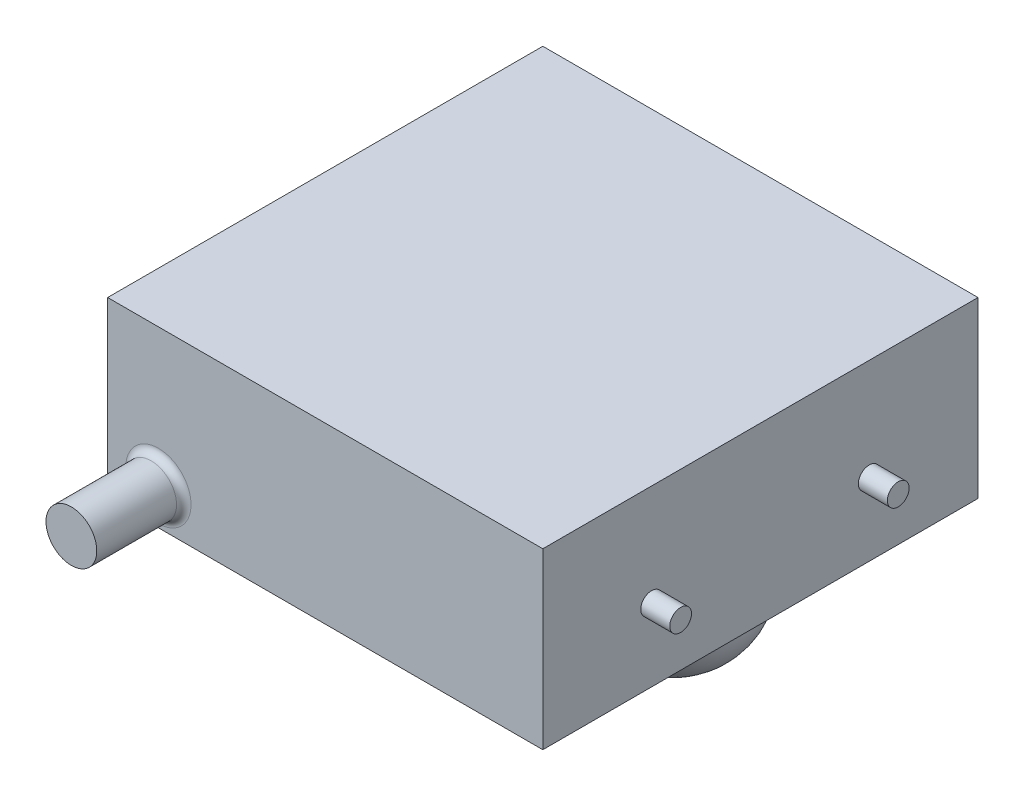
ISO-10303-21;
HEADER;
FILE_DESCRIPTION(('STEP AP214'),'2;1');
FILE_NAME('part.step','',(''),(''),'','','');
FILE_SCHEMA(('AUTOMOTIVE_DESIGN { 1 0 10303 214 1 1 1 1 }'));
ENDSEC;
DATA;
#1=APPLICATION_CONTEXT('core data for automotive mechanical design processes');
#2=APPLICATION_PROTOCOL_DEFINITION('international standard','automotive_design',2000,#1);
#3=PRODUCT_CONTEXT('',#1,'mechanical');
#4=PRODUCT('Part','Part','',(#3));
#5=PRODUCT_RELATED_PRODUCT_CATEGORY('part','',(#4));
#6=PRODUCT_DEFINITION_FORMATION('','',#4);
#7=PRODUCT_DEFINITION_CONTEXT('part definition',#1,'design');
#8=PRODUCT_DEFINITION('design','',#6,#7);
#9=PRODUCT_DEFINITION_SHAPE('','',#8);
#10=(LENGTH_UNIT() NAMED_UNIT(*) SI_UNIT(.MILLI.,.METRE.));
#11=(NAMED_UNIT(*) PLANE_ANGLE_UNIT() SI_UNIT($,.RADIAN.));
#12=(NAMED_UNIT(*) SI_UNIT($,.STERADIAN.) SOLID_ANGLE_UNIT());
#13=UNCERTAINTY_MEASURE_WITH_UNIT(LENGTH_MEASURE(1.E-05),#10,'distance_accuracy_value','');
#14=(GEOMETRIC_REPRESENTATION_CONTEXT(3) GLOBAL_UNCERTAINTY_ASSIGNED_CONTEXT((#13)) GLOBAL_UNIT_ASSIGNED_CONTEXT((#10,
#11,#12)) REPRESENTATION_CONTEXT('',''));
#15=CARTESIAN_POINT('',(0.,0.,0.));
#16=DIRECTION('',(0.,0.,1.));
#17=DIRECTION('',(1.,0.,0.));
#18=AXIS2_PLACEMENT_3D('',#15,#16,#17);
#19=CARTESIAN_POINT('',(150.,120.,-150.));
#20=DIRECTION('',(-1.,0.,0.));
#21=DIRECTION('',(0.,0.,1.));
#22=AXIS2_PLACEMENT_3D('',#19,#20,#21);
#23=PLANE('',#22);
#24=CARTESIAN_POINT('',(150.,50.,-75.));
#25=DIRECTION('',(-1.,0.,0.));
#26=DIRECTION('',(0.,0.,1.));
#27=AXIS2_PLACEMENT_3D('',#24,#25,#26);
#28=CIRCLE('',#27,7.50000000000001);
#29=CARTESIAN_POINT('',(150.,50.,-67.5));
#30=VERTEX_POINT('',#29);
#31=EDGE_CURVE('E11',#30,#30,#28,.F.);
#32=ORIENTED_EDGE('',*,*,#31,.F.);
#33=EDGE_LOOP('',(#32));
#34=FACE_BOUND('',#33,.T.);
#35=CARTESIAN_POINT('',(150.,50.,75.));
#36=DIRECTION('',(-1.,0.,0.));
#37=DIRECTION('',(0.,0.,1.));
#38=AXIS2_PLACEMENT_3D('',#35,#36,#37);
#39=CIRCLE('',#38,7.50000000000001);
#40=CARTESIAN_POINT('',(150.,50.,82.5));
#41=VERTEX_POINT('',#40);
#42=EDGE_CURVE('E48',#41,#41,#39,.F.);
#43=ORIENTED_EDGE('',*,*,#42,.F.);
#44=EDGE_LOOP('',(#43));
#45=FACE_BOUND('',#44,.T.);
#46=DIRECTION('',(0.,0.,-1.));
#47=VECTOR('',#46,1.);
#48=CARTESIAN_POINT('',(150.,0.,-150.));
#49=LINE('',#48,#47);
#50=CARTESIAN_POINT('',(150.,0.,150.));
#51=VERTEX_POINT('',#50);
#52=CARTESIAN_POINT('',(150.,0.,-150.));
#53=VERTEX_POINT('',#52);
#54=EDGE_CURVE('E107',#51,#53,#49,.T.);
#55=ORIENTED_EDGE('',*,*,#54,.T.);
#56=DIRECTION('',(0.,-1.,0.));
#57=VECTOR('',#56,1.);
#58=CARTESIAN_POINT('',(150.,120.,-150.));
#59=LINE('',#58,#57);
#60=CARTESIAN_POINT('',(150.,120.,-150.));
#61=VERTEX_POINT('',#60);
#62=EDGE_CURVE('E98',#61,#53,#59,.T.);
#63=ORIENTED_EDGE('',*,*,#62,.F.);
#64=DIRECTION('',(0.,0.,-1.));
#65=VECTOR('',#64,1.);
#66=CARTESIAN_POINT('',(150.,120.,-150.));
#67=LINE('',#66,#65);
#68=CARTESIAN_POINT('',(150.,120.,150.));
#69=VERTEX_POINT('',#68);
#70=EDGE_CURVE('E92',#69,#61,#67,.T.);
#71=ORIENTED_EDGE('',*,*,#70,.F.);
#72=DIRECTION('',(0.,-1.,0.));
#73=VECTOR('',#72,1.);
#74=CARTESIAN_POINT('',(150.,120.,150.));
#75=LINE('',#74,#73);
#76=EDGE_CURVE('E103',#69,#51,#75,.T.);
#77=ORIENTED_EDGE('',*,*,#76,.T.);
#78=EDGE_LOOP('',(#55,#63,#71,#77));
#79=FACE_BOUND('',#78,.T.);
#80=ADVANCED_FACE('F39',(#34,#45,#79),#23,.F.);
#81=CARTESIAN_POINT('',(-150.,120.,-150.));
#82=DIRECTION('',(0.,0.,1.));
#83=DIRECTION('',(1.,0.,0.));
#84=AXIS2_PLACEMENT_3D('',#81,#82,#83);
#85=PLANE('',#84);
#86=CARTESIAN_POINT('',(-115.,25.,-150.));
#87=DIRECTION('',(0.,0.,1.));
#88=DIRECTION('',(1.,0.,0.));
#89=AXIS2_PLACEMENT_3D('',#86,#87,#88);
#90=CIRCLE('',#89,22.5);
#91=CARTESIAN_POINT('',(-92.5,25.,-150.));
#92=VERTEX_POINT('',#91);
#93=EDGE_CURVE('E123',#92,#92,#90,.T.);
#94=ORIENTED_EDGE('',*,*,#93,.T.);
#95=EDGE_LOOP('',(#94));
#96=FACE_BOUND('',#95,.T.);
#97=DIRECTION('',(-1.,0.,0.));
#98=VECTOR('',#97,1.);
#99=CARTESIAN_POINT('',(-150.,0.,-150.));
#100=LINE('',#99,#98);
#101=CARTESIAN_POINT('',(-150.,0.,-150.));
#102=VERTEX_POINT('',#101);
#103=EDGE_CURVE('E97',#53,#102,#100,.T.);
#104=ORIENTED_EDGE('',*,*,#103,.T.);
#105=DIRECTION('',(0.,-1.,0.));
#106=VECTOR('',#105,1.);
#107=CARTESIAN_POINT('',(-150.,120.,-150.));
#108=LINE('',#107,#106);
#109=CARTESIAN_POINT('',(-150.,120.,-150.));
#110=VERTEX_POINT('',#109);
#111=EDGE_CURVE('E95',#110,#102,#108,.T.);
#112=ORIENTED_EDGE('',*,*,#111,.F.);
#113=DIRECTION('',(-1.,0.,0.));
#114=VECTOR('',#113,1.);
#115=CARTESIAN_POINT('',(-150.,120.,-150.));
#116=LINE('',#115,#114);
#117=EDGE_CURVE('E87',#61,#110,#116,.T.);
#118=ORIENTED_EDGE('',*,*,#117,.F.);
#119=ORIENTED_EDGE('',*,*,#62,.T.);
#120=EDGE_LOOP('',(#104,#112,#118,#119));
#121=FACE_BOUND('',#120,.T.);
#122=ADVANCED_FACE('F96',(#96,#121),#85,.F.);
#123=CARTESIAN_POINT('',(-150.,120.,-150.));
#124=DIRECTION('',(1.,0.,0.));
#125=DIRECTION('',(0.,0.,-1.));
#126=AXIS2_PLACEMENT_3D('',#123,#124,#125);
#127=PLANE('',#126);
#128=DIRECTION('',(0.,0.,1.));
#129=VECTOR('',#128,1.);
#130=CARTESIAN_POINT('',(-150.,0.,-150.));
#131=LINE('',#130,#129);
#132=CARTESIAN_POINT('',(-150.,0.,150.));
#133=VERTEX_POINT('',#132);
#134=EDGE_CURVE('E73',#102,#133,#131,.T.);
#135=ORIENTED_EDGE('',*,*,#134,.T.);
#136=DIRECTION('',(0.,-1.,0.));
#137=VECTOR('',#136,1.);
#138=CARTESIAN_POINT('',(-150.,120.,150.));
#139=LINE('',#138,#137);
#140=CARTESIAN_POINT('',(-150.,120.,150.));
#141=VERTEX_POINT('',#140);
#142=EDGE_CURVE('E99',#141,#133,#139,.T.);
#143=ORIENTED_EDGE('',*,*,#142,.F.);
#144=DIRECTION('',(0.,0.,1.));
#145=VECTOR('',#144,1.);
#146=CARTESIAN_POINT('',(-150.,120.,-150.));
#147=LINE('',#146,#145);
#148=EDGE_CURVE('E90',#110,#141,#147,.T.);
#149=ORIENTED_EDGE('',*,*,#148,.F.);
#150=ORIENTED_EDGE('',*,*,#111,.T.);
#151=EDGE_LOOP('',(#135,#143,#149,#150));
#152=FACE_BOUND('',#151,.T.);
#153=ADVANCED_FACE('F101',(#152),#127,.F.);
#154=CARTESIAN_POINT('',(-150.,120.,150.));
#155=DIRECTION('',(0.,0.,-1.));
#156=DIRECTION('',(-1.,0.,0.));
#157=AXIS2_PLACEMENT_3D('',#154,#155,#156);
#158=PLANE('',#157);
#159=CARTESIAN_POINT('',(-115.,25.,150.));
#160=DIRECTION('',(0.,0.,-1.));
#161=DIRECTION('',(-1.,0.,0.));
#162=AXIS2_PLACEMENT_3D('',#159,#160,#161);
#163=CIRCLE('',#162,22.5);
#164=CARTESIAN_POINT('',(-137.5,25.,150.));
#165=VERTEX_POINT('',#164);
#166=EDGE_CURVE('E120',#165,#165,#163,.T.);
#167=ORIENTED_EDGE('',*,*,#166,.T.);
#168=EDGE_LOOP('',(#167));
#169=FACE_BOUND('',#168,.T.);
#170=DIRECTION('',(1.,0.,0.));
#171=VECTOR('',#170,1.);
#172=CARTESIAN_POINT('',(-150.,0.,150.));
#173=LINE('',#172,#171);
#174=EDGE_CURVE('E79',#133,#51,#173,.T.);
#175=ORIENTED_EDGE('',*,*,#174,.T.);
#176=ORIENTED_EDGE('',*,*,#76,.F.);
#177=DIRECTION('',(1.,0.,0.));
#178=VECTOR('',#177,1.);
#179=CARTESIAN_POINT('',(-150.,120.,150.));
#180=LINE('',#179,#178);
#181=EDGE_CURVE('E56',#141,#69,#180,.T.);
#182=ORIENTED_EDGE('',*,*,#181,.F.);
#183=ORIENTED_EDGE('',*,*,#142,.T.);
#184=EDGE_LOOP('',(#175,#176,#182,#183));
#185=FACE_BOUND('',#184,.T.);
#186=ADVANCED_FACE('F157',(#169,#185),#158,.F.);
#187=CARTESIAN_POINT('',(0.,120.,0.));
#188=DIRECTION('',(0.,1.,0.));
#189=DIRECTION('',(0.,0.,1.));
#190=AXIS2_PLACEMENT_3D('',#187,#188,#189);
#191=PLANE('',#190);
#192=ORIENTED_EDGE('',*,*,#70,.T.);
#193=ORIENTED_EDGE('',*,*,#117,.T.);
#194=ORIENTED_EDGE('',*,*,#148,.T.);
#195=ORIENTED_EDGE('',*,*,#181,.T.);
#196=EDGE_LOOP('',(#192,#193,#194,#195));
#197=FACE_BOUND('',#196,.T.);
#198=ADVANCED_FACE('F88',(#197),#191,.T.);
#199=CARTESIAN_POINT('',(0.,0.,0.));
#200=DIRECTION('',(0.,1.,0.));
#201=DIRECTION('',(0.,0.,1.));
#202=AXIS2_PLACEMENT_3D('',#199,#200,#201);
#203=PLANE('',#202);
#204=CARTESIAN_POINT('',(90.,0.,0.));
#205=DIRECTION('',(0.,1.,0.));
#206=DIRECTION('',(0.,0.,1.));
#207=AXIS2_PLACEMENT_3D('',#204,#205,#206);
#208=CIRCLE('',#207,51.);
#209=CARTESIAN_POINT('',(90.,0.,51.));
#210=VERTEX_POINT('',#209);
#211=EDGE_CURVE('E129',#210,#210,#208,.F.);
#212=ORIENTED_EDGE('',*,*,#211,.F.);
#213=EDGE_LOOP('',(#212));
#214=FACE_BOUND('',#213,.T.);
#215=ORIENTED_EDGE('',*,*,#54,.F.);
#216=ORIENTED_EDGE('',*,*,#174,.F.);
#217=ORIENTED_EDGE('',*,*,#134,.F.);
#218=ORIENTED_EDGE('',*,*,#103,.F.);
#219=EDGE_LOOP('',(#215,#216,#217,#218));
#220=FACE_BOUND('',#219,.T.);
#221=ADVANCED_FACE('F145',(#214,#220),#203,.F.);
#222=CARTESIAN_POINT('',(-115.,25.,210.));
#223=DIRECTION('',(0.,0.,-1.));
#224=DIRECTION('',(-1.,0.,0.));
#225=AXIS2_PLACEMENT_3D('',#222,#223,#224);
#226=CYLINDRICAL_SURFACE('',#225,17.5);
#227=CARTESIAN_POINT('',(-115.,25.,155.));
#228=DIRECTION('',(0.,0.,-1.));
#229=DIRECTION('',(-1.,0.,0.));
#230=AXIS2_PLACEMENT_3D('',#227,#228,#229);
#231=CIRCLE('',#230,17.5);
#232=CARTESIAN_POINT('',(-132.5,25.,155.));
#233=VERTEX_POINT('',#232);
#234=EDGE_CURVE('E117',#233,#233,#231,.F.);
#235=CARTESIAN_POINT('',(-115.,25.,210.));
#236=DIRECTION('',(0.,0.,1.));
#237=DIRECTION('',(1.,0.,0.));
#238=AXIS2_PLACEMENT_3D('',#235,#236,#237);
#239=CIRCLE('',#238,17.5);
#240=CARTESIAN_POINT('',(-132.5,25.,210.));
#241=VERTEX_POINT('',#240);
#242=EDGE_CURVE('E110',#241,#241,#239,.T.);
#243=CARTESIAN_POINT('',(-132.5,25.,155.));
#244=CARTESIAN_POINT('',(-132.5,25.,155.572916666667));
#245=CARTESIAN_POINT('',(-132.5,25.,156.145833333333));
#246=CARTESIAN_POINT('',(-132.5,25.,157.291666666667));
#247=CARTESIAN_POINT('',(-132.5,25.,157.864583333333));
#248=CARTESIAN_POINT('',(-132.5,25.,159.010416666667));
#249=CARTESIAN_POINT('',(-132.5,25.,159.583333333333));
#250=CARTESIAN_POINT('',(-132.5,25.,160.729166666667));
#251=CARTESIAN_POINT('',(-132.5,25.,161.302083333333));
#252=CARTESIAN_POINT('',(-132.5,25.,162.447916666667));
#253=CARTESIAN_POINT('',(-132.5,25.,163.020833333333));
#254=CARTESIAN_POINT('',(-132.5,25.,164.166666666667));
#255=CARTESIAN_POINT('',(-132.5,25.,164.739583333333));
#256=CARTESIAN_POINT('',(-132.5,25.,165.885416666667));
#257=CARTESIAN_POINT('',(-132.5,25.,166.458333333333));
#258=CARTESIAN_POINT('',(-132.5,25.,167.604166666667));
#259=CARTESIAN_POINT('',(-132.5,25.,168.177083333333));
#260=CARTESIAN_POINT('',(-132.5,25.,169.322916666667));
#261=CARTESIAN_POINT('',(-132.5,25.,169.895833333333));
#262=CARTESIAN_POINT('',(-132.5,25.,171.041666666667));
#263=CARTESIAN_POINT('',(-132.5,25.,171.614583333333));
#264=CARTESIAN_POINT('',(-132.5,25.,172.760416666667));
#265=CARTESIAN_POINT('',(-132.5,25.,173.333333333333));
#266=CARTESIAN_POINT('',(-132.5,25.,174.479166666667));
#267=CARTESIAN_POINT('',(-132.5,25.,175.052083333333));
#268=CARTESIAN_POINT('',(-132.5,25.,176.197916666667));
#269=CARTESIAN_POINT('',(-132.5,25.,176.770833333333));
#270=CARTESIAN_POINT('',(-132.5,25.,177.916666666667));
#271=CARTESIAN_POINT('',(-132.5,25.,178.489583333333));
#272=CARTESIAN_POINT('',(-132.5,25.,179.635416666667));
#273=CARTESIAN_POINT('',(-132.5,25.,180.208333333333));
#274=CARTESIAN_POINT('',(-132.5,25.,181.354166666667));
#275=CARTESIAN_POINT('',(-132.5,25.,181.927083333333));
#276=CARTESIAN_POINT('',(-132.5,25.,183.072916666667));
#277=CARTESIAN_POINT('',(-132.5,25.,183.645833333333));
#278=CARTESIAN_POINT('',(-132.5,25.,184.791666666667));
#279=CARTESIAN_POINT('',(-132.5,25.,185.364583333333));
#280=CARTESIAN_POINT('',(-132.5,25.,186.510416666667));
#281=CARTESIAN_POINT('',(-132.5,25.,187.083333333333));
#282=CARTESIAN_POINT('',(-132.5,25.,188.229166666667));
#283=CARTESIAN_POINT('',(-132.5,25.,188.802083333333));
#284=CARTESIAN_POINT('',(-132.5,25.,189.947916666667));
#285=CARTESIAN_POINT('',(-132.5,25.,190.520833333333));
#286=CARTESIAN_POINT('',(-132.5,25.,191.666666666667));
#287=CARTESIAN_POINT('',(-132.5,25.,192.239583333333));
#288=CARTESIAN_POINT('',(-132.5,25.,193.385416666667));
#289=CARTESIAN_POINT('',(-132.5,25.,193.958333333333));
#290=CARTESIAN_POINT('',(-132.5,25.,195.104166666667));
#291=CARTESIAN_POINT('',(-132.5,25.,195.677083333333));
#292=CARTESIAN_POINT('',(-132.5,25.,196.822916666667));
#293=CARTESIAN_POINT('',(-132.5,25.,197.395833333333));
#294=CARTESIAN_POINT('',(-132.5,25.,198.541666666667));
#295=CARTESIAN_POINT('',(-132.5,25.,199.114583333333));
#296=CARTESIAN_POINT('',(-132.5,25.,200.260416666667));
#297=CARTESIAN_POINT('',(-132.5,25.,200.833333333333));
#298=CARTESIAN_POINT('',(-132.5,25.,201.979166666667));
#299=CARTESIAN_POINT('',(-132.5,25.,202.552083333333));
#300=CARTESIAN_POINT('',(-132.5,25.,203.697916666667));
#301=CARTESIAN_POINT('',(-132.5,25.,204.270833333333));
#302=CARTESIAN_POINT('',(-132.5,25.,205.416666666667));
#303=CARTESIAN_POINT('',(-132.5,25.,205.989583333333));
#304=CARTESIAN_POINT('',(-132.5,25.,207.135416666667));
#305=CARTESIAN_POINT('',(-132.5,25.,207.708333333333));
#306=CARTESIAN_POINT('',(-132.5,25.,208.854166666667));
#307=CARTESIAN_POINT('',(-132.5,25.,209.427083333333));
#308=CARTESIAN_POINT('',(-132.5,25.,210.));
#309=B_SPLINE_CURVE_WITH_KNOTS('',3,(#243,#244,#245,#246,#247,#248,#249,#250,#251,#252,#253,
#254,#255,#256,#257,#258,#259,#260,#261,#262,#263,#264,#265,#266,#267,#268,#269,#270,#271,#272,
#273,#274,#275,#276,#277,#278,#279,#280,#281,#282,#283,#284,#285,#286,#287,#288,#289,#290,#291,
#292,#293,#294,#295,#296,#297,#298,#299,#300,#301,#302,#303,#304,#305,#306,#307,#308),
.UNSPECIFIED.,.F.,.F.,(4,2,2,2,2,2,2,2,2,2,2,2,2,2,2,2,2,2,2,2,2,2,2,2,2,2,2,2,2,2,2,2,4),(0.,
1.71874999999999,3.43749999999998,5.15625,6.87499999999999,8.59374999999998,10.3125,12.03125,
13.75,15.46875,17.1875,18.90625,20.625,22.34375,24.0625,25.78125,27.5,29.21875,30.9375,32.65625,
34.375,36.09375,37.8125,39.53125,41.25,42.96875,44.6875,46.40625,48.125,49.84375,51.5625,
53.2812499999999,55.),.UNSPECIFIED.);
#310=EDGE_CURVE('BSEAM147',#233,#241,#309,.T.);
#311=ORIENTED_EDGE('',*,*,#234,.T.);
#312=ORIENTED_EDGE('',*,*,#242,.F.);
#313=ORIENTED_EDGE('',*,*,#310,.T.);
#314=ORIENTED_EDGE('',*,*,#310,.F.);
#315=EDGE_LOOP('',(#311,#313,#312,#314));
#316=FACE_BOUND('',#315,.T.);
#317=ADVANCED_FACE('F147',(#316),#226,.T.);
#318=CARTESIAN_POINT('',(-115.,25.,210.));
#319=DIRECTION('',(0.,0.,1.));
#320=DIRECTION('',(1.,0.,0.));
#321=AXIS2_PLACEMENT_3D('',#318,#319,#320);
#322=PLANE('',#321);
#323=ORIENTED_EDGE('',*,*,#242,.T.);
#324=EDGE_LOOP('',(#323));
#325=FACE_BOUND('',#324,.T.);
#326=ADVANCED_FACE('F154',(#325),#322,.T.);
#327=CARTESIAN_POINT('',(-115.,25.,-210.));
#328=DIRECTION('',(0.,0.,1.));
#329=DIRECTION('',(1.,0.,0.));
#330=AXIS2_PLACEMENT_3D('',#327,#328,#329);
#331=CYLINDRICAL_SURFACE('',#330,17.5);
#332=CARTESIAN_POINT('',(-115.,25.,-155.));
#333=DIRECTION('',(0.,0.,1.));
#334=DIRECTION('',(1.,0.,0.));
#335=AXIS2_PLACEMENT_3D('',#332,#333,#334);
#336=CIRCLE('',#335,17.5);
#337=CARTESIAN_POINT('',(-97.5,25.,-155.));
#338=VERTEX_POINT('',#337);
#339=EDGE_CURVE('E126',#338,#338,#336,.F.);
#340=CARTESIAN_POINT('',(-115.,25.,-210.));
#341=DIRECTION('',(0.,0.,1.));
#342=DIRECTION('',(1.,0.,0.));
#343=AXIS2_PLACEMENT_3D('',#340,#341,#342);
#344=CIRCLE('',#343,17.5);
#345=CARTESIAN_POINT('',(-97.5,25.,-210.));
#346=VERTEX_POINT('',#345);
#347=EDGE_CURVE('E192',#346,#346,#344,.T.);
#348=CARTESIAN_POINT('',(-97.5,25.,-155.));
#349=CARTESIAN_POINT('',(-97.5,25.,-155.572916666667));
#350=CARTESIAN_POINT('',(-97.5,25.,-156.145833333333));
#351=CARTESIAN_POINT('',(-97.5,25.,-157.291666666667));
#352=CARTESIAN_POINT('',(-97.5,25.,-157.864583333333));
#353=CARTESIAN_POINT('',(-97.5,25.,-159.010416666667));
#354=CARTESIAN_POINT('',(-97.5,25.,-159.583333333333));
#355=CARTESIAN_POINT('',(-97.5,25.,-160.729166666667));
#356=CARTESIAN_POINT('',(-97.5,25.,-161.302083333333));
#357=CARTESIAN_POINT('',(-97.5,25.,-162.447916666667));
#358=CARTESIAN_POINT('',(-97.5,25.,-163.020833333333));
#359=CARTESIAN_POINT('',(-97.5,25.,-164.166666666667));
#360=CARTESIAN_POINT('',(-97.5,25.,-164.739583333333));
#361=CARTESIAN_POINT('',(-97.5,25.,-165.885416666667));
#362=CARTESIAN_POINT('',(-97.5,25.,-166.458333333333));
#363=CARTESIAN_POINT('',(-97.5,25.,-167.604166666667));
#364=CARTESIAN_POINT('',(-97.5,25.,-168.177083333333));
#365=CARTESIAN_POINT('',(-97.5,25.,-169.322916666667));
#366=CARTESIAN_POINT('',(-97.5,25.,-169.895833333333));
#367=CARTESIAN_POINT('',(-97.5,25.,-171.041666666667));
#368=CARTESIAN_POINT('',(-97.5,25.,-171.614583333333));
#369=CARTESIAN_POINT('',(-97.5,25.,-172.760416666667));
#370=CARTESIAN_POINT('',(-97.5,25.,-173.333333333333));
#371=CARTESIAN_POINT('',(-97.5,25.,-174.479166666667));
#372=CARTESIAN_POINT('',(-97.5,25.,-175.052083333333));
#373=CARTESIAN_POINT('',(-97.5,25.,-176.197916666667));
#374=CARTESIAN_POINT('',(-97.5,25.,-176.770833333333));
#375=CARTESIAN_POINT('',(-97.5,25.,-177.916666666667));
#376=CARTESIAN_POINT('',(-97.5,25.,-178.489583333333));
#377=CARTESIAN_POINT('',(-97.5,25.,-179.635416666667));
#378=CARTESIAN_POINT('',(-97.5,25.,-180.208333333333));
#379=CARTESIAN_POINT('',(-97.5,25.,-181.354166666667));
#380=CARTESIAN_POINT('',(-97.5,25.,-181.927083333333));
#381=CARTESIAN_POINT('',(-97.5,25.,-183.072916666667));
#382=CARTESIAN_POINT('',(-97.5,25.,-183.645833333333));
#383=CARTESIAN_POINT('',(-97.5,25.,-184.791666666667));
#384=CARTESIAN_POINT('',(-97.5,25.,-185.364583333333));
#385=CARTESIAN_POINT('',(-97.5,25.,-186.510416666667));
#386=CARTESIAN_POINT('',(-97.5,25.,-187.083333333333));
#387=CARTESIAN_POINT('',(-97.5,25.,-188.229166666667));
#388=CARTESIAN_POINT('',(-97.5,25.,-188.802083333333));
#389=CARTESIAN_POINT('',(-97.5,25.,-189.947916666667));
#390=CARTESIAN_POINT('',(-97.5,25.,-190.520833333333));
#391=CARTESIAN_POINT('',(-97.5,25.,-191.666666666667));
#392=CARTESIAN_POINT('',(-97.5,25.,-192.239583333333));
#393=CARTESIAN_POINT('',(-97.5,25.,-193.385416666667));
#394=CARTESIAN_POINT('',(-97.5,25.,-193.958333333333));
#395=CARTESIAN_POINT('',(-97.5,25.,-195.104166666667));
#396=CARTESIAN_POINT('',(-97.5,25.,-195.677083333333));
#397=CARTESIAN_POINT('',(-97.5,25.,-196.822916666667));
#398=CARTESIAN_POINT('',(-97.5,25.,-197.395833333333));
#399=CARTESIAN_POINT('',(-97.5,25.,-198.541666666667));
#400=CARTESIAN_POINT('',(-97.5,25.,-199.114583333333));
#401=CARTESIAN_POINT('',(-97.5,25.,-200.260416666667));
#402=CARTESIAN_POINT('',(-97.5,25.,-200.833333333333));
#403=CARTESIAN_POINT('',(-97.5,25.,-201.979166666667));
#404=CARTESIAN_POINT('',(-97.5,25.,-202.552083333333));
#405=CARTESIAN_POINT('',(-97.5,25.,-203.697916666667));
#406=CARTESIAN_POINT('',(-97.5,25.,-204.270833333333));
#407=CARTESIAN_POINT('',(-97.5,25.,-205.416666666667));
#408=CARTESIAN_POINT('',(-97.5,25.,-205.989583333333));
#409=CARTESIAN_POINT('',(-97.5,25.,-207.135416666667));
#410=CARTESIAN_POINT('',(-97.5,25.,-207.708333333333));
#411=CARTESIAN_POINT('',(-97.5,25.,-208.854166666667));
#412=CARTESIAN_POINT('',(-97.5,25.,-209.427083333333));
#413=CARTESIAN_POINT('',(-97.5,25.,-210.));
#414=B_SPLINE_CURVE_WITH_KNOTS('',3,(#348,#349,#350,#351,#352,#353,#354,#355,#356,#357,#358,
#359,#360,#361,#362,#363,#364,#365,#366,#367,#368,#369,#370,#371,#372,#373,#374,#375,#376,#377,
#378,#379,#380,#381,#382,#383,#384,#385,#386,#387,#388,#389,#390,#391,#392,#393,#394,#395,#396,
#397,#398,#399,#400,#401,#402,#403,#404,#405,#406,#407,#408,#409,#410,#411,#412,#413),
.UNSPECIFIED.,.F.,.F.,(4,2,2,2,2,2,2,2,2,2,2,2,2,2,2,2,2,2,2,2,2,2,2,2,2,2,2,2,2,2,2,2,4),(0.,
1.71875000000002,3.43750000000001,5.15625,6.87499999999999,8.59374999999998,10.3125,12.03125,
13.75,15.46875,17.1875,18.90625,20.625,22.34375,24.0625,25.78125,27.5,29.21875,30.9375,32.65625,
34.375,36.09375,37.8124999999999,39.53125,41.25,42.9687499999999,44.6874999999999,
46.4062499999999,48.1249999999999,49.8437499999999,51.5624999999999,53.2812499999999,
54.9999999999999),.UNSPECIFIED.);
#415=EDGE_CURVE('BSEAM186',#338,#346,#414,.T.);
#416=ORIENTED_EDGE('',*,*,#339,.T.);
#417=ORIENTED_EDGE('',*,*,#347,.T.);
#418=ORIENTED_EDGE('',*,*,#415,.T.);
#419=ORIENTED_EDGE('',*,*,#415,.F.);
#420=EDGE_LOOP('',(#416,#418,#417,#419));
#421=FACE_BOUND('',#420,.T.);
#422=ADVANCED_FACE('F186',(#421),#331,.T.);
#423=CARTESIAN_POINT('',(-115.,25.,-210.));
#424=DIRECTION('',(0.,0.,-1.));
#425=DIRECTION('',(1.,0.,0.));
#426=AXIS2_PLACEMENT_3D('',#423,#424,#425);
#427=PLANE('',#426);
#428=ORIENTED_EDGE('',*,*,#347,.F.);
#429=EDGE_LOOP('',(#428));
#430=FACE_BOUND('',#429,.T.);
#431=ADVANCED_FACE('F172',(#430),#427,.T.);
#432=CARTESIAN_POINT('',(-115.,25.,155.));
#433=DIRECTION('',(0.,0.,-1.));
#434=DIRECTION('',(-1.,0.,0.));
#435=AXIS2_PLACEMENT_3D('',#432,#433,#434);
#436=TOROIDAL_SURFACE('',#435,22.5,5.);
#437=ORIENTED_EDGE('',*,*,#166,.F.);
#438=EDGE_LOOP('',(#437));
#439=FACE_BOUND('',#438,.T.);
#440=ORIENTED_EDGE('',*,*,#234,.F.);
#441=EDGE_LOOP('',(#440));
#442=FACE_BOUND('',#441,.T.);
#443=ADVANCED_FACE('F169',(#439,#442),#436,.F.);
#444=CARTESIAN_POINT('',(-115.,25.,-155.));
#445=DIRECTION('',(0.,0.,1.));
#446=DIRECTION('',(1.,0.,0.));
#447=AXIS2_PLACEMENT_3D('',#444,#445,#446);
#448=TOROIDAL_SURFACE('',#447,22.5,5.);
#449=ORIENTED_EDGE('',*,*,#339,.F.);
#450=EDGE_LOOP('',(#449));
#451=FACE_BOUND('',#450,.T.);
#452=ORIENTED_EDGE('',*,*,#93,.F.);
#453=EDGE_LOOP('',(#452));
#454=FACE_BOUND('',#453,.T.);
#455=ADVANCED_FACE('F171',(#451,#454),#448,.F.);
#456=CARTESIAN_POINT('',(90.,-50.,0.));
#457=DIRECTION('',(0.,-1.,0.));
#458=DIRECTION('',(0.,0.,-1.));
#459=AXIS2_PLACEMENT_3D('',#456,#457,#458);
#460=PLANE('',#459);
#461=CARTESIAN_POINT('',(90.,-50.,0.));
#462=DIRECTION('',(0.,-1.,0.));
#463=DIRECTION('',(0.,0.,-1.));
#464=AXIS2_PLACEMENT_3D('',#461,#462,#463);
#465=CIRCLE('',#464,0.99999999999998);
#466=CARTESIAN_POINT('',(90.,-50.,-0.99999999999998));
#467=VERTEX_POINT('',#466);
#468=EDGE_CURVE('E132',#467,#467,#465,.T.);
#469=ORIENTED_EDGE('',*,*,#468,.T.);
#470=EDGE_LOOP('',(#469));
#471=FACE_BOUND('',#470,.T.);
#472=ADVANCED_FACE('F175',(#471),#460,.T.);
#473=CARTESIAN_POINT('',(90.,0.,0.));
#474=DIRECTION('',(0.,-1.,0.));
#475=DIRECTION('',(0.,0.,-1.));
#476=AXIS2_PLACEMENT_3D('',#473,#474,#475);
#477=DEGENERATE_TOROIDAL_SURFACE('',#476,0.99999999999998,50.,.T.);
#478=ORIENTED_EDGE('',*,*,#211,.T.);
#479=EDGE_LOOP('',(#478));
#480=FACE_BOUND('',#479,.T.);
#481=ORIENTED_EDGE('',*,*,#468,.F.);
#482=EDGE_LOOP('',(#481));
#483=FACE_BOUND('',#482,.T.);
#484=ADVANCED_FACE('F41',(#480,#483),#477,.T.);
#485=CARTESIAN_POINT('',(170.,50.,75.));
#486=DIRECTION('',(-1.,0.,0.));
#487=DIRECTION('',(0.,0.,1.));
#488=AXIS2_PLACEMENT_3D('',#485,#486,#487);
#489=CYLINDRICAL_SURFACE('',#488,7.50000000000001);
#490=CARTESIAN_POINT('',(170.,50.,75.));
#491=DIRECTION('',(1.,0.,0.));
#492=DIRECTION('',(0.,0.,-1.));
#493=AXIS2_PLACEMENT_3D('',#490,#491,#492);
#494=CIRCLE('',#493,7.50000000000001);
#495=CARTESIAN_POINT('',(170.,50.,67.5));
#496=VERTEX_POINT('',#495);
#497=EDGE_CURVE('E194',#496,#496,#494,.T.);
#498=ORIENTED_EDGE('',*,*,#497,.F.);
#499=EDGE_LOOP('',(#498));
#500=FACE_BOUND('',#499,.T.);
#501=ORIENTED_EDGE('',*,*,#42,.T.);
#502=EDGE_LOOP('',(#501));
#503=FACE_BOUND('',#502,.T.);
#504=ADVANCED_FACE('F137',(#500,#503),#489,.T.);
#505=CARTESIAN_POINT('',(170.,50.,75.));
#506=DIRECTION('',(1.,0.,0.));
#507=DIRECTION('',(0.,0.,-1.));
#508=AXIS2_PLACEMENT_3D('',#505,#506,#507);
#509=PLANE('',#508);
#510=ORIENTED_EDGE('',*,*,#497,.T.);
#511=EDGE_LOOP('',(#510));
#512=FACE_BOUND('',#511,.T.);
#513=ADVANCED_FACE('F210',(#512),#509,.T.);
#514=CARTESIAN_POINT('',(170.,50.,-75.));
#515=DIRECTION('',(-1.,0.,0.));
#516=DIRECTION('',(0.,0.,1.));
#517=AXIS2_PLACEMENT_3D('',#514,#515,#516);
#518=CYLINDRICAL_SURFACE('',#517,7.50000000000001);
#519=CARTESIAN_POINT('',(170.,50.,-75.));
#520=DIRECTION('',(1.,0.,0.));
#521=DIRECTION('',(0.,0.,-1.));
#522=AXIS2_PLACEMENT_3D('',#519,#520,#521);
#523=CIRCLE('',#522,7.50000000000001);
#524=CARTESIAN_POINT('',(170.,50.,-82.5));
#525=VERTEX_POINT('',#524);
#526=EDGE_CURVE('E199',#525,#525,#523,.T.);
#527=ORIENTED_EDGE('',*,*,#526,.F.);
#528=EDGE_LOOP('',(#527));
#529=FACE_BOUND('',#528,.T.);
#530=ORIENTED_EDGE('',*,*,#31,.T.);
#531=EDGE_LOOP('',(#530));
#532=FACE_BOUND('',#531,.T.);
#533=ADVANCED_FACE('F207',(#529,#532),#518,.T.);
#534=CARTESIAN_POINT('',(170.,50.,-75.));
#535=DIRECTION('',(1.,0.,0.));
#536=DIRECTION('',(0.,0.,-1.));
#537=AXIS2_PLACEMENT_3D('',#534,#535,#536);
#538=PLANE('',#537);
#539=ORIENTED_EDGE('',*,*,#526,.T.);
#540=EDGE_LOOP('',(#539));
#541=FACE_BOUND('',#540,.T.);
#542=ADVANCED_FACE('F205',(#541),#538,.T.);
#543=CLOSED_SHELL('',(#80,#122,#153,#186,#198,#221,#317,#326,#422,#431,#443,#455,#472,#484,#504,
#513,#533,#542));
#544=MANIFOLD_SOLID_BREP('B2',#543);
#545=ADVANCED_BREP_SHAPE_REPRESENTATION('',(#18,#544),#14);
#546=SHAPE_DEFINITION_REPRESENTATION(#9,#545);
ENDSEC;
END-ISO-10303-21;
